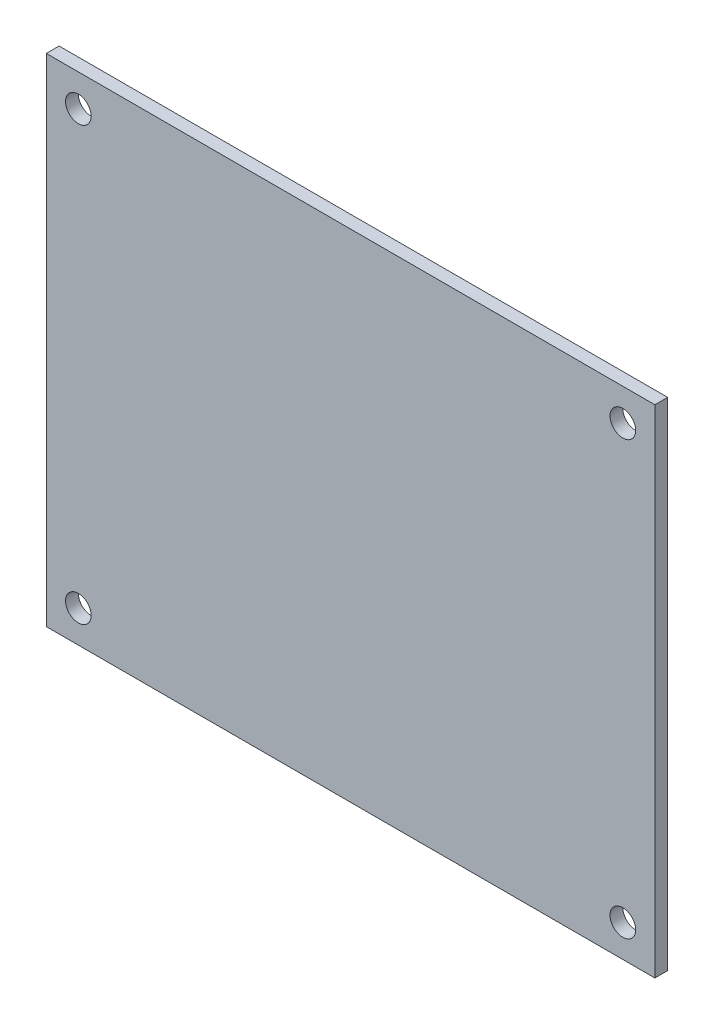
ISO-10303-21;
HEADER;
FILE_DESCRIPTION(('STEP AP214'),'2;1');
FILE_NAME('part.step','',(''),(''),'','','');
FILE_SCHEMA(('AUTOMOTIVE_DESIGN { 1 0 10303 214 1 1 1 1 }'));
ENDSEC;
DATA;
#1=APPLICATION_CONTEXT('core data for automotive mechanical design processes');
#2=APPLICATION_PROTOCOL_DEFINITION('international standard','automotive_design',2000,#1);
#3=PRODUCT_CONTEXT('',#1,'mechanical');
#4=PRODUCT('Part','Part','',(#3));
#5=PRODUCT_RELATED_PRODUCT_CATEGORY('part','',(#4));
#6=PRODUCT_DEFINITION_FORMATION('','',#4);
#7=PRODUCT_DEFINITION_CONTEXT('part definition',#1,'design');
#8=PRODUCT_DEFINITION('design','',#6,#7);
#9=PRODUCT_DEFINITION_SHAPE('','',#8);
#10=(LENGTH_UNIT() NAMED_UNIT(*) SI_UNIT(.MILLI.,.METRE.));
#11=(NAMED_UNIT(*) PLANE_ANGLE_UNIT() SI_UNIT($,.RADIAN.));
#12=(NAMED_UNIT(*) SI_UNIT($,.STERADIAN.) SOLID_ANGLE_UNIT());
#13=UNCERTAINTY_MEASURE_WITH_UNIT(LENGTH_MEASURE(1.E-05),#10,'distance_accuracy_value','');
#14=(GEOMETRIC_REPRESENTATION_CONTEXT(3) GLOBAL_UNCERTAINTY_ASSIGNED_CONTEXT((#13)) GLOBAL_UNIT_ASSIGNED_CONTEXT((#10,
#11,#12)) REPRESENTATION_CONTEXT('',''));
#15=CARTESIAN_POINT('',(0.,0.,0.));
#16=DIRECTION('',(0.,0.,1.));
#17=DIRECTION('',(1.,0.,0.));
#18=AXIS2_PLACEMENT_3D('',#15,#16,#17);
#19=CARTESIAN_POINT('',(0.,0.,1.6));
#20=DIRECTION('',(0.,0.,1.));
#21=DIRECTION('',(1.,0.,0.));
#22=AXIS2_PLACEMENT_3D('',#19,#20,#21);
#23=PLANE('',#22);
#24=CARTESIAN_POINT('',(34.,-27.,1.6));
#25=DIRECTION('',(0.,0.,1.));
#26=DIRECTION('',(1.,0.,0.));
#27=AXIS2_PLACEMENT_3D('',#24,#25,#26);
#28=CIRCLE('',#27,1.6);
#29=CARTESIAN_POINT('',(35.6,-27.,1.6));
#30=VERTEX_POINT('',#29);
#31=EDGE_CURVE('E121',#30,#30,#28,.T.);
#32=ORIENTED_EDGE('',*,*,#31,.F.);
#33=EDGE_LOOP('',(#32));
#34=FACE_BOUND('',#33,.T.);
#35=CARTESIAN_POINT('',(34.,27.,1.6));
#36=DIRECTION('',(0.,0.,1.));
#37=DIRECTION('',(1.,0.,0.));
#38=AXIS2_PLACEMENT_3D('',#35,#36,#37);
#39=CIRCLE('',#38,1.6);
#40=CARTESIAN_POINT('',(35.6,27.,1.6));
#41=VERTEX_POINT('',#40);
#42=EDGE_CURVE('E100',#41,#41,#39,.T.);
#43=ORIENTED_EDGE('',*,*,#42,.F.);
#44=EDGE_LOOP('',(#43));
#45=FACE_BOUND('',#44,.T.);
#46=DIRECTION('',(0.,-1.,0.));
#47=VECTOR('',#46,1.);
#48=CARTESIAN_POINT('',(-38.,31.,1.6));
#49=LINE('',#48,#47);
#50=CARTESIAN_POINT('',(-38.,31.,1.6));
#51=VERTEX_POINT('',#50);
#52=CARTESIAN_POINT('',(-38.,-31.,1.6));
#53=VERTEX_POINT('',#52);
#54=EDGE_CURVE('E85',#51,#53,#49,.T.);
#55=ORIENTED_EDGE('',*,*,#54,.T.);
#56=DIRECTION('',(1.,0.,0.));
#57=VECTOR('',#56,1.);
#58=CARTESIAN_POINT('',(-38.,-31.,1.6));
#59=LINE('',#58,#57);
#60=CARTESIAN_POINT('',(38.,-31.,1.6));
#61=VERTEX_POINT('',#60);
#62=EDGE_CURVE('E80',#53,#61,#59,.T.);
#63=ORIENTED_EDGE('',*,*,#62,.T.);
#64=DIRECTION('',(0.,1.,0.));
#65=VECTOR('',#64,1.);
#66=CARTESIAN_POINT('',(38.,31.,1.6));
#67=LINE('',#66,#65);
#68=CARTESIAN_POINT('',(38.,31.,1.6));
#69=VERTEX_POINT('',#68);
#70=EDGE_CURVE('E83',#61,#69,#67,.T.);
#71=ORIENTED_EDGE('',*,*,#70,.T.);
#72=DIRECTION('',(-1.,0.,0.));
#73=VECTOR('',#72,1.);
#74=CARTESIAN_POINT('',(-38.,31.,1.6));
#75=LINE('',#74,#73);
#76=EDGE_CURVE('E50',#69,#51,#75,.T.);
#77=ORIENTED_EDGE('',*,*,#76,.T.);
#78=EDGE_LOOP('',(#55,#63,#71,#77));
#79=FACE_BOUND('',#78,.T.);
#80=CARTESIAN_POINT('',(-34.,27.,1.6));
#81=DIRECTION('',(0.,0.,1.));
#82=DIRECTION('',(1.,0.,0.));
#83=AXIS2_PLACEMENT_3D('',#80,#81,#82);
#84=CIRCLE('',#83,1.6);
#85=CARTESIAN_POINT('',(-32.4,27.,1.6));
#86=VERTEX_POINT('',#85);
#87=EDGE_CURVE('E115',#86,#86,#84,.T.);
#88=ORIENTED_EDGE('',*,*,#87,.F.);
#89=EDGE_LOOP('',(#88));
#90=FACE_BOUND('',#89,.T.);
#91=CARTESIAN_POINT('',(-34.,-27.,1.6));
#92=DIRECTION('',(0.,0.,1.));
#93=DIRECTION('',(1.,0.,0.));
#94=AXIS2_PLACEMENT_3D('',#91,#92,#93);
#95=CIRCLE('',#94,1.6);
#96=CARTESIAN_POINT('',(-32.4,-27.,1.6));
#97=VERTEX_POINT('',#96);
#98=EDGE_CURVE('E127',#97,#97,#95,.T.);
#99=ORIENTED_EDGE('',*,*,#98,.F.);
#100=EDGE_LOOP('',(#99));
#101=FACE_BOUND('',#100,.T.);
#102=ADVANCED_FACE('F33',(#34,#45,#79,#90,#101),#23,.T.);
#103=CARTESIAN_POINT('',(0.,0.,0.));
#104=DIRECTION('',(0.,0.,1.));
#105=DIRECTION('',(1.,0.,0.));
#106=AXIS2_PLACEMENT_3D('',#103,#104,#105);
#107=PLANE('',#106);
#108=DIRECTION('',(0.,-1.,0.));
#109=VECTOR('',#108,1.);
#110=CARTESIAN_POINT('',(-38.,31.,0.));
#111=LINE('',#110,#109);
#112=CARTESIAN_POINT('',(-38.,31.,0.));
#113=VERTEX_POINT('',#112);
#114=CARTESIAN_POINT('',(-38.,-31.,0.));
#115=VERTEX_POINT('',#114);
#116=EDGE_CURVE('E97',#113,#115,#111,.T.);
#117=ORIENTED_EDGE('',*,*,#116,.F.);
#118=DIRECTION('',(-1.,0.,0.));
#119=VECTOR('',#118,1.);
#120=CARTESIAN_POINT('',(-38.,31.,0.));
#121=LINE('',#120,#119);
#122=CARTESIAN_POINT('',(38.,31.,0.));
#123=VERTEX_POINT('',#122);
#124=EDGE_CURVE('E73',#123,#113,#121,.T.);
#125=ORIENTED_EDGE('',*,*,#124,.F.);
#126=DIRECTION('',(0.,1.,0.));
#127=VECTOR('',#126,1.);
#128=CARTESIAN_POINT('',(38.,31.,0.));
#129=LINE('',#128,#127);
#130=CARTESIAN_POINT('',(38.,-31.,0.));
#131=VERTEX_POINT('',#130);
#132=EDGE_CURVE('E67',#131,#123,#129,.T.);
#133=ORIENTED_EDGE('',*,*,#132,.F.);
#134=DIRECTION('',(1.,0.,0.));
#135=VECTOR('',#134,1.);
#136=CARTESIAN_POINT('',(-38.,-31.,0.));
#137=LINE('',#136,#135);
#138=EDGE_CURVE('E89',#115,#131,#137,.T.);
#139=ORIENTED_EDGE('',*,*,#138,.F.);
#140=EDGE_LOOP('',(#117,#125,#133,#139));
#141=FACE_BOUND('',#140,.T.);
#142=CARTESIAN_POINT('',(34.,27.,0.));
#143=DIRECTION('',(0.,0.,1.));
#144=DIRECTION('',(1.,0.,0.));
#145=AXIS2_PLACEMENT_3D('',#142,#143,#144);
#146=CIRCLE('',#145,1.6);
#147=CARTESIAN_POINT('',(35.6,27.,0.));
#148=VERTEX_POINT('',#147);
#149=EDGE_CURVE('E112',#148,#148,#146,.T.);
#150=ORIENTED_EDGE('',*,*,#149,.T.);
#151=EDGE_LOOP('',(#150));
#152=FACE_BOUND('',#151,.T.);
#153=CARTESIAN_POINT('',(-34.,27.,0.));
#154=DIRECTION('',(0.,0.,1.));
#155=DIRECTION('',(1.,0.,0.));
#156=AXIS2_PLACEMENT_3D('',#153,#154,#155);
#157=CIRCLE('',#156,1.6);
#158=CARTESIAN_POINT('',(-32.4,27.,0.));
#159=VERTEX_POINT('',#158);
#160=EDGE_CURVE('E118',#159,#159,#157,.T.);
#161=ORIENTED_EDGE('',*,*,#160,.T.);
#162=EDGE_LOOP('',(#161));
#163=FACE_BOUND('',#162,.T.);
#164=CARTESIAN_POINT('',(34.,-27.,0.));
#165=DIRECTION('',(0.,0.,1.));
#166=DIRECTION('',(1.,0.,0.));
#167=AXIS2_PLACEMENT_3D('',#164,#165,#166);
#168=CIRCLE('',#167,1.6);
#169=CARTESIAN_POINT('',(35.6,-27.,0.));
#170=VERTEX_POINT('',#169);
#171=EDGE_CURVE('E124',#170,#170,#168,.T.);
#172=ORIENTED_EDGE('',*,*,#171,.T.);
#173=EDGE_LOOP('',(#172));
#174=FACE_BOUND('',#173,.T.);
#175=CARTESIAN_POINT('',(-34.,-27.,0.));
#176=DIRECTION('',(0.,0.,1.));
#177=DIRECTION('',(1.,0.,0.));
#178=AXIS2_PLACEMENT_3D('',#175,#176,#177);
#179=CIRCLE('',#178,1.6);
#180=CARTESIAN_POINT('',(-32.4,-27.,0.));
#181=VERTEX_POINT('',#180);
#182=EDGE_CURVE('E130',#181,#181,#179,.T.);
#183=ORIENTED_EDGE('',*,*,#182,.T.);
#184=EDGE_LOOP('',(#183));
#185=FACE_BOUND('',#184,.T.);
#186=ADVANCED_FACE('F108',(#141,#152,#163,#174,#185),#107,.F.);
#187=CARTESIAN_POINT('',(-38.,31.,1.6));
#188=DIRECTION('',(1.,0.,0.));
#189=DIRECTION('',(0.,0.,-1.));
#190=AXIS2_PLACEMENT_3D('',#187,#188,#189);
#191=PLANE('',#190);
#192=ORIENTED_EDGE('',*,*,#116,.T.);
#193=DIRECTION('',(0.,0.,-1.));
#194=VECTOR('',#193,1.);
#195=CARTESIAN_POINT('',(-38.,-31.,1.6));
#196=LINE('',#195,#194);
#197=EDGE_CURVE('E11',#53,#115,#196,.T.);
#198=ORIENTED_EDGE('',*,*,#197,.F.);
#199=ORIENTED_EDGE('',*,*,#54,.F.);
#200=DIRECTION('',(0.,0.,-1.));
#201=VECTOR('',#200,1.);
#202=CARTESIAN_POINT('',(-38.,31.,1.6));
#203=LINE('',#202,#201);
#204=EDGE_CURVE('E93',#51,#113,#203,.T.);
#205=ORIENTED_EDGE('',*,*,#204,.T.);
#206=EDGE_LOOP('',(#192,#198,#199,#205));
#207=FACE_BOUND('',#206,.T.);
#208=ADVANCED_FACE('F35',(#207),#191,.F.);
#209=CARTESIAN_POINT('',(-38.,-31.,1.6));
#210=DIRECTION('',(0.,1.,0.));
#211=DIRECTION('',(-1.,0.,0.));
#212=AXIS2_PLACEMENT_3D('',#209,#210,#211);
#213=PLANE('',#212);
#214=ORIENTED_EDGE('',*,*,#138,.T.);
#215=DIRECTION('',(0.,0.,-1.));
#216=VECTOR('',#215,1.);
#217=CARTESIAN_POINT('',(38.,-31.,1.6));
#218=LINE('',#217,#216);
#219=EDGE_CURVE('E42',#61,#131,#218,.T.);
#220=ORIENTED_EDGE('',*,*,#219,.F.);
#221=ORIENTED_EDGE('',*,*,#62,.F.);
#222=ORIENTED_EDGE('',*,*,#197,.T.);
#223=EDGE_LOOP('',(#214,#220,#221,#222));
#224=FACE_BOUND('',#223,.T.);
#225=ADVANCED_FACE('F88',(#224),#213,.F.);
#226=CARTESIAN_POINT('',(38.,31.,1.6));
#227=DIRECTION('',(-1.,0.,0.));
#228=DIRECTION('',(0.,-1.,0.));
#229=AXIS2_PLACEMENT_3D('',#226,#227,#228);
#230=PLANE('',#229);
#231=ORIENTED_EDGE('',*,*,#132,.T.);
#232=DIRECTION('',(0.,0.,-1.));
#233=VECTOR('',#232,1.);
#234=CARTESIAN_POINT('',(38.,31.,1.6));
#235=LINE('',#234,#233);
#236=EDGE_CURVE('E90',#69,#123,#235,.T.);
#237=ORIENTED_EDGE('',*,*,#236,.F.);
#238=ORIENTED_EDGE('',*,*,#70,.F.);
#239=ORIENTED_EDGE('',*,*,#219,.T.);
#240=EDGE_LOOP('',(#231,#237,#238,#239));
#241=FACE_BOUND('',#240,.T.);
#242=ADVANCED_FACE('F91',(#241),#230,.F.);
#243=CARTESIAN_POINT('',(-38.,31.,1.6));
#244=DIRECTION('',(0.,-1.,0.));
#245=DIRECTION('',(0.,0.,-1.));
#246=AXIS2_PLACEMENT_3D('',#243,#244,#245);
#247=PLANE('',#246);
#248=ORIENTED_EDGE('',*,*,#124,.T.);
#249=ORIENTED_EDGE('',*,*,#204,.F.);
#250=ORIENTED_EDGE('',*,*,#76,.F.);
#251=ORIENTED_EDGE('',*,*,#236,.T.);
#252=EDGE_LOOP('',(#248,#249,#250,#251));
#253=FACE_BOUND('',#252,.T.);
#254=ADVANCED_FACE('F105',(#253),#247,.F.);
#255=CARTESIAN_POINT('',(34.,27.,1.6));
#256=DIRECTION('',(0.,0.,-1.));
#257=DIRECTION('',(-1.,0.,0.));
#258=AXIS2_PLACEMENT_3D('',#255,#256,#257);
#259=CYLINDRICAL_SURFACE('',#258,1.6);
#260=ORIENTED_EDGE('',*,*,#42,.T.);
#261=EDGE_LOOP('',(#260));
#262=FACE_BOUND('',#261,.T.);
#263=ORIENTED_EDGE('',*,*,#149,.F.);
#264=EDGE_LOOP('',(#263));
#265=FACE_BOUND('',#264,.T.);
#266=ADVANCED_FACE('F149',(#262,#265),#259,.F.);
#267=CARTESIAN_POINT('',(-34.,27.,1.6));
#268=DIRECTION('',(0.,0.,-1.));
#269=DIRECTION('',(-1.,0.,0.));
#270=AXIS2_PLACEMENT_3D('',#267,#268,#269);
#271=CYLINDRICAL_SURFACE('',#270,1.6);
#272=ORIENTED_EDGE('',*,*,#87,.T.);
#273=EDGE_LOOP('',(#272));
#274=FACE_BOUND('',#273,.T.);
#275=ORIENTED_EDGE('',*,*,#160,.F.);
#276=EDGE_LOOP('',(#275));
#277=FACE_BOUND('',#276,.T.);
#278=ADVANCED_FACE('F195',(#274,#277),#271,.F.);
#279=CARTESIAN_POINT('',(34.,-27.,1.6));
#280=DIRECTION('',(0.,0.,-1.));
#281=DIRECTION('',(-1.,0.,0.));
#282=AXIS2_PLACEMENT_3D('',#279,#280,#281);
#283=CYLINDRICAL_SURFACE('',#282,1.6);
#284=ORIENTED_EDGE('',*,*,#31,.T.);
#285=EDGE_LOOP('',(#284));
#286=FACE_BOUND('',#285,.T.);
#287=ORIENTED_EDGE('',*,*,#171,.F.);
#288=EDGE_LOOP('',(#287));
#289=FACE_BOUND('',#288,.T.);
#290=ADVANCED_FACE('F203',(#286,#289),#283,.F.);
#291=CARTESIAN_POINT('',(-34.,-27.,1.6));
#292=DIRECTION('',(0.,0.,-1.));
#293=DIRECTION('',(-1.,0.,0.));
#294=AXIS2_PLACEMENT_3D('',#291,#292,#293);
#295=CYLINDRICAL_SURFACE('',#294,1.6);
#296=ORIENTED_EDGE('',*,*,#98,.T.);
#297=EDGE_LOOP('',(#296));
#298=FACE_BOUND('',#297,.T.);
#299=ORIENTED_EDGE('',*,*,#182,.F.);
#300=EDGE_LOOP('',(#299));
#301=FACE_BOUND('',#300,.T.);
#302=ADVANCED_FACE('F136',(#298,#301),#295,.F.);
#303=CLOSED_SHELL('',(#102,#186,#208,#225,#242,#254,#266,#278,#290,#302));
#304=MANIFOLD_SOLID_BREP('B2',#303);
#305=ADVANCED_BREP_SHAPE_REPRESENTATION('',(#18,#304),#14);
#306=SHAPE_DEFINITION_REPRESENTATION(#9,#305);
ENDSEC;
END-ISO-10303-21;
